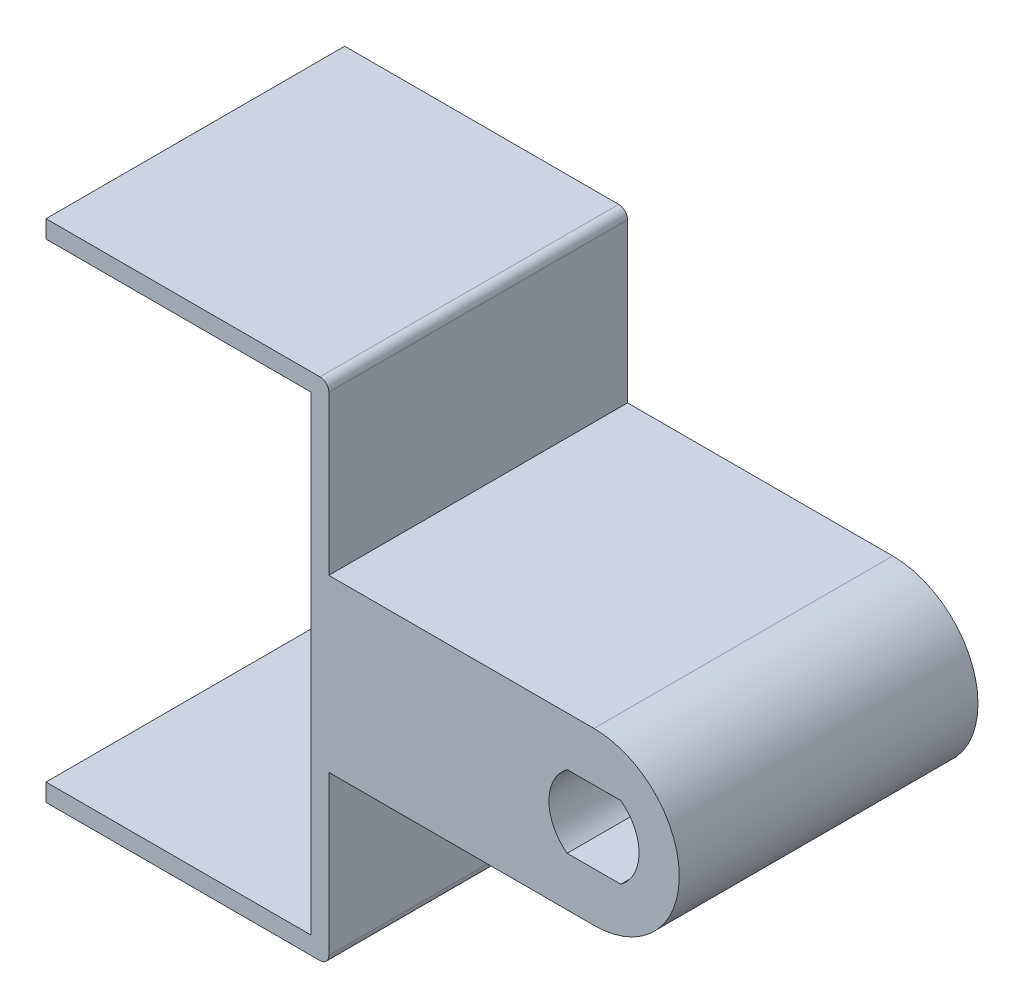
ISO-10303-21;
HEADER;
FILE_DESCRIPTION(('STEP AP214'),'2;1');
FILE_NAME('part.step','',(''),(''),'','','');
FILE_SCHEMA(('AUTOMOTIVE_DESIGN { 1 0 10303 214 1 1 1 1 }'));
ENDSEC;
DATA;
#1=APPLICATION_CONTEXT('core data for automotive mechanical design processes');
#2=APPLICATION_PROTOCOL_DEFINITION('international standard','automotive_design',2000,#1);
#3=PRODUCT_CONTEXT('',#1,'mechanical');
#4=PRODUCT('Part','Part','',(#3));
#5=PRODUCT_RELATED_PRODUCT_CATEGORY('part','',(#4));
#6=PRODUCT_DEFINITION_FORMATION('','',#4);
#7=PRODUCT_DEFINITION_CONTEXT('part definition',#1,'design');
#8=PRODUCT_DEFINITION('design','',#6,#7);
#9=PRODUCT_DEFINITION_SHAPE('','',#8);
#10=(LENGTH_UNIT() NAMED_UNIT(*) SI_UNIT(.MILLI.,.METRE.));
#11=(NAMED_UNIT(*) PLANE_ANGLE_UNIT() SI_UNIT($,.RADIAN.));
#12=(NAMED_UNIT(*) SI_UNIT($,.STERADIAN.) SOLID_ANGLE_UNIT());
#13=UNCERTAINTY_MEASURE_WITH_UNIT(LENGTH_MEASURE(1.E-05),#10,'distance_accuracy_value','');
#14=(GEOMETRIC_REPRESENTATION_CONTEXT(3) GLOBAL_UNCERTAINTY_ASSIGNED_CONTEXT((#13)) GLOBAL_UNIT_ASSIGNED_CONTEXT((#10,
#11,#12)) REPRESENTATION_CONTEXT('',''));
#15=CARTESIAN_POINT('',(0.,0.,0.));
#16=DIRECTION('',(0.,0.,1.));
#17=DIRECTION('',(1.,0.,0.));
#18=AXIS2_PLACEMENT_3D('',#15,#16,#17);
#19=CARTESIAN_POINT('',(21.,-14.3,16.9));
#20=DIRECTION('',(-1.,0.,0.));
#21=DIRECTION('',(0.,0.,1.));
#22=AXIS2_PLACEMENT_3D('',#19,#20,#21);
#23=PLANE('',#22);
#24=DIRECTION('',(0.,1.,0.));
#25=VECTOR('',#24,1.);
#26=CARTESIAN_POINT('',(21.,-14.3,0.));
#27=LINE('',#26,#25);
#28=CARTESIAN_POINT('',(21.,4.825,0.));
#29=VERTEX_POINT('',#28);
#30=CARTESIAN_POINT('',(21.,13.8,0.));
#31=VERTEX_POINT('',#30);
#32=EDGE_CURVE('E232',#29,#31,#27,.T.);
#33=ORIENTED_EDGE('',*,*,#32,.T.);
#34=DIRECTION('',(0.,0.,-1.));
#35=VECTOR('',#34,1.);
#36=CARTESIAN_POINT('',(21.,13.8,16.9));
#37=LINE('',#36,#35);
#38=CARTESIAN_POINT('',(21.,13.8,16.9));
#39=VERTEX_POINT('',#38);
#40=EDGE_CURVE('E55',#31,#39,#37,.F.);
#41=ORIENTED_EDGE('',*,*,#40,.T.);
#42=DIRECTION('',(0.,1.,0.));
#43=VECTOR('',#42,1.);
#44=CARTESIAN_POINT('',(21.,-14.3,16.9));
#45=LINE('',#44,#43);
#46=CARTESIAN_POINT('',(21.,4.825,16.9));
#47=VERTEX_POINT('',#46);
#48=EDGE_CURVE('E218',#47,#39,#45,.T.);
#49=ORIENTED_EDGE('',*,*,#48,.F.);
#50=DIRECTION('',(0.,0.,-1.));
#51=VECTOR('',#50,1.);
#52=CARTESIAN_POINT('',(21.,4.825,13.5));
#53=LINE('',#52,#51);
#54=EDGE_CURVE('E367',#47,#29,#53,.T.);
#55=ORIENTED_EDGE('',*,*,#54,.T.);
#56=EDGE_LOOP('',(#33,#41,#49,#55));
#57=FACE_BOUND('',#56,.T.);
#58=ADVANCED_FACE('F46',(#57),#23,.F.);
#59=CARTESIAN_POINT('',(21.,-13.8,16.9));
#60=VERTEX_POINT('',#59);
#61=CARTESIAN_POINT('',(21.,-4.825,16.9));
#62=VERTEX_POINT('',#61);
#63=EDGE_CURVE('E212',#60,#62,#45,.T.);
#64=ORIENTED_EDGE('',*,*,#63,.F.);
#65=DIRECTION('',(0.,0.,-1.));
#66=VECTOR('',#65,1.);
#67=CARTESIAN_POINT('',(21.,-13.8,16.9));
#68=LINE('',#67,#66);
#69=CARTESIAN_POINT('',(21.,-13.8,0.));
#70=VERTEX_POINT('',#69);
#71=EDGE_CURVE('E12',#60,#70,#68,.T.);
#72=ORIENTED_EDGE('',*,*,#71,.T.);
#73=CARTESIAN_POINT('',(21.,-4.825,0.));
#74=VERTEX_POINT('',#73);
#75=EDGE_CURVE('E234',#70,#74,#27,.T.);
#76=ORIENTED_EDGE('',*,*,#75,.T.);
#77=DIRECTION('',(0.,0.,-1.));
#78=VECTOR('',#77,1.);
#79=CARTESIAN_POINT('',(21.,-4.825,13.5));
#80=LINE('',#79,#78);
#81=EDGE_CURVE('E233',#62,#74,#80,.T.);
#82=ORIENTED_EDGE('',*,*,#81,.F.);
#83=EDGE_LOOP('',(#64,#72,#76,#82));
#84=FACE_BOUND('',#83,.T.);
#85=ADVANCED_FACE('F340',(#84),#23,.F.);
#86=CARTESIAN_POINT('',(-20.,-14.3,16.9));
#87=DIRECTION('',(0.,1.,0.));
#88=DIRECTION('',(0.,0.,1.));
#89=AXIS2_PLACEMENT_3D('',#86,#87,#88);
#90=PLANE('',#89);
#91=DIRECTION('',(1.,0.,0.));
#92=VECTOR('',#91,1.);
#93=CARTESIAN_POINT('',(-20.,-14.3,16.9));
#94=LINE('',#93,#92);
#95=CARTESIAN_POINT('',(5.,-14.3,16.9));
#96=VERTEX_POINT('',#95);
#97=CARTESIAN_POINT('',(20.5,-14.3,16.9));
#98=VERTEX_POINT('',#97);
#99=EDGE_CURVE('E249',#96,#98,#94,.T.);
#100=ORIENTED_EDGE('',*,*,#99,.F.);
#101=DIRECTION('',(0.,0.,-1.));
#102=VECTOR('',#101,1.);
#103=CARTESIAN_POINT('',(5.,-14.3,16.9));
#104=LINE('',#103,#102);
#105=CARTESIAN_POINT('',(5.,-14.3,0.));
#106=VERTEX_POINT('',#105);
#107=EDGE_CURVE('E202',#96,#106,#104,.T.);
#108=ORIENTED_EDGE('',*,*,#107,.T.);
#109=DIRECTION('',(1.,0.,0.));
#110=VECTOR('',#109,1.);
#111=CARTESIAN_POINT('',(-20.,-14.3,0.));
#112=LINE('',#111,#110);
#113=CARTESIAN_POINT('',(20.5,-14.3,0.));
#114=VERTEX_POINT('',#113);
#115=EDGE_CURVE('E229',#106,#114,#112,.T.);
#116=ORIENTED_EDGE('',*,*,#115,.T.);
#117=DIRECTION('',(0.,0.,-1.));
#118=VECTOR('',#117,1.);
#119=CARTESIAN_POINT('',(20.5,-14.3,16.9));
#120=LINE('',#119,#118);
#121=EDGE_CURVE('E362',#114,#98,#120,.F.);
#122=ORIENTED_EDGE('',*,*,#121,.T.);
#123=EDGE_LOOP('',(#100,#108,#116,#122));
#124=FACE_BOUND('',#123,.T.);
#125=ADVANCED_FACE('F346',(#124),#90,.F.);
#126=CARTESIAN_POINT('',(21.,14.3,16.9));
#127=DIRECTION('',(0.,-1.,0.));
#128=DIRECTION('',(1.,0.,0.));
#129=AXIS2_PLACEMENT_3D('',#126,#127,#128);
#130=PLANE('',#129);
#131=DIRECTION('',(-1.,0.,0.));
#132=VECTOR('',#131,1.);
#133=CARTESIAN_POINT('',(21.,14.3,0.));
#134=LINE('',#133,#132);
#135=CARTESIAN_POINT('',(20.5,14.3,0.));
#136=VERTEX_POINT('',#135);
#137=CARTESIAN_POINT('',(5.,14.3,0.));
#138=VERTEX_POINT('',#137);
#139=EDGE_CURVE('E200',#136,#138,#134,.T.);
#140=ORIENTED_EDGE('',*,*,#139,.T.);
#141=DIRECTION('',(0.,0.,-1.));
#142=VECTOR('',#141,1.);
#143=CARTESIAN_POINT('',(5.,14.3,16.9));
#144=LINE('',#143,#142);
#145=CARTESIAN_POINT('',(5.,14.3,16.9));
#146=VERTEX_POINT('',#145);
#147=EDGE_CURVE('E70',#146,#138,#144,.T.);
#148=ORIENTED_EDGE('',*,*,#147,.F.);
#149=DIRECTION('',(-1.,0.,0.));
#150=VECTOR('',#149,1.);
#151=CARTESIAN_POINT('',(21.,14.3,16.9));
#152=LINE('',#151,#150);
#153=CARTESIAN_POINT('',(20.5,14.3,16.9));
#154=VERTEX_POINT('',#153);
#155=EDGE_CURVE('E197',#154,#146,#152,.T.);
#156=ORIENTED_EDGE('',*,*,#155,.F.);
#157=DIRECTION('',(0.,0.,-1.));
#158=VECTOR('',#157,1.);
#159=CARTESIAN_POINT('',(20.5,14.3,16.9));
#160=LINE('',#159,#158);
#161=EDGE_CURVE('E754',#154,#136,#160,.T.);
#162=ORIENTED_EDGE('',*,*,#161,.T.);
#163=EDGE_LOOP('',(#140,#148,#156,#162));
#164=FACE_BOUND('',#163,.T.);
#165=ADVANCED_FACE('F195',(#164),#130,.F.);
#166=CARTESIAN_POINT('',(20.,13.3,16.9));
#167=DIRECTION('',(0.,1.,0.));
#168=DIRECTION('',(0.,0.,1.));
#169=AXIS2_PLACEMENT_3D('',#166,#167,#168);
#170=PLANE('',#169);
#171=DIRECTION('',(1.,0.,0.));
#172=VECTOR('',#171,1.);
#173=CARTESIAN_POINT('',(20.,13.3,16.9));
#174=LINE('',#173,#172);
#175=CARTESIAN_POINT('',(5.,13.3,16.9));
#176=VERTEX_POINT('',#175);
#177=CARTESIAN_POINT('',(20.,13.3,16.9));
#178=VERTEX_POINT('',#177);
#179=EDGE_CURVE('E211',#176,#178,#174,.T.);
#180=ORIENTED_EDGE('',*,*,#179,.F.);
#181=DIRECTION('',(0.,0.,-1.));
#182=VECTOR('',#181,1.);
#183=CARTESIAN_POINT('',(5.,13.3,16.9));
#184=LINE('',#183,#182);
#185=CARTESIAN_POINT('',(5.,13.3,0.));
#186=VERTEX_POINT('',#185);
#187=EDGE_CURVE('E185',#176,#186,#184,.T.);
#188=ORIENTED_EDGE('',*,*,#187,.T.);
#189=DIRECTION('',(1.,0.,0.));
#190=VECTOR('',#189,1.);
#191=CARTESIAN_POINT('',(20.,13.3,0.));
#192=LINE('',#191,#190);
#193=CARTESIAN_POINT('',(20.,13.3,0.));
#194=VERTEX_POINT('',#193);
#195=EDGE_CURVE('E239',#186,#194,#192,.T.);
#196=ORIENTED_EDGE('',*,*,#195,.T.);
#197=DIRECTION('',(0.,0.,-1.));
#198=VECTOR('',#197,1.);
#199=CARTESIAN_POINT('',(20.,13.3,16.9));
#200=LINE('',#199,#198);
#201=EDGE_CURVE('E253',#178,#194,#200,.T.);
#202=ORIENTED_EDGE('',*,*,#201,.F.);
#203=EDGE_LOOP('',(#180,#188,#196,#202));
#204=FACE_BOUND('',#203,.T.);
#205=ADVANCED_FACE('F356',(#204),#170,.F.);
#206=CARTESIAN_POINT('',(20.,-13.3,16.9));
#207=DIRECTION('',(1.,0.,0.));
#208=DIRECTION('',(0.,0.,-1.));
#209=AXIS2_PLACEMENT_3D('',#206,#207,#208);
#210=PLANE('',#209);
#211=DIRECTION('',(0.,-1.,0.));
#212=VECTOR('',#211,1.);
#213=CARTESIAN_POINT('',(20.,-13.3,0.));
#214=LINE('',#213,#212);
#215=CARTESIAN_POINT('',(20.,-13.3,0.));
#216=VERTEX_POINT('',#215);
#217=EDGE_CURVE('E242',#194,#216,#214,.T.);
#218=ORIENTED_EDGE('',*,*,#217,.T.);
#219=DIRECTION('',(0.,0.,-1.));
#220=VECTOR('',#219,1.);
#221=CARTESIAN_POINT('',(20.,-13.3,16.9));
#222=LINE('',#221,#220);
#223=CARTESIAN_POINT('',(20.,-13.3,16.9));
#224=VERTEX_POINT('',#223);
#225=EDGE_CURVE('E228',#224,#216,#222,.T.);
#226=ORIENTED_EDGE('',*,*,#225,.F.);
#227=DIRECTION('',(0.,-1.,0.));
#228=VECTOR('',#227,1.);
#229=CARTESIAN_POINT('',(20.,-13.3,16.9));
#230=LINE('',#229,#228);
#231=EDGE_CURVE('E216',#178,#224,#230,.T.);
#232=ORIENTED_EDGE('',*,*,#231,.F.);
#233=ORIENTED_EDGE('',*,*,#201,.T.);
#234=EDGE_LOOP('',(#218,#226,#232,#233));
#235=FACE_BOUND('',#234,.T.);
#236=ADVANCED_FACE('F467',(#235),#210,.F.);
#237=CARTESIAN_POINT('',(-20.,-13.3,16.9));
#238=DIRECTION('',(0.,-1.,0.));
#239=DIRECTION('',(0.,0.,-1.));
#240=AXIS2_PLACEMENT_3D('',#237,#238,#239);
#241=PLANE('',#240);
#242=DIRECTION('',(-1.,0.,0.));
#243=VECTOR('',#242,1.);
#244=CARTESIAN_POINT('',(-20.,-13.3,0.));
#245=LINE('',#244,#243);
#246=CARTESIAN_POINT('',(5.,-13.3,0.));
#247=VERTEX_POINT('',#246);
#248=EDGE_CURVE('E245',#216,#247,#245,.T.);
#249=ORIENTED_EDGE('',*,*,#248,.T.);
#250=DIRECTION('',(0.,0.,1.));
#251=VECTOR('',#250,1.);
#252=CARTESIAN_POINT('',(5.,-13.3,16.9));
#253=LINE('',#252,#251);
#254=CARTESIAN_POINT('',(5.,-13.3,16.9));
#255=VERTEX_POINT('',#254);
#256=EDGE_CURVE('E62',#247,#255,#253,.T.);
#257=ORIENTED_EDGE('',*,*,#256,.T.);
#258=DIRECTION('',(-1.,0.,0.));
#259=VECTOR('',#258,1.);
#260=CARTESIAN_POINT('',(-20.,-13.3,16.9));
#261=LINE('',#260,#259);
#262=EDGE_CURVE('E224',#224,#255,#261,.T.);
#263=ORIENTED_EDGE('',*,*,#262,.F.);
#264=ORIENTED_EDGE('',*,*,#225,.T.);
#265=EDGE_LOOP('',(#249,#257,#263,#264));
#266=FACE_BOUND('',#265,.T.);
#267=ADVANCED_FACE('F462',(#266),#241,.F.);
#268=CARTESIAN_POINT('',(0.,0.,16.9));
#269=DIRECTION('',(0.,0.,1.));
#270=DIRECTION('',(1.,0.,0.));
#271=AXIS2_PLACEMENT_3D('',#268,#269,#270);
#272=PLANE('',#271);
#273=DIRECTION('',(0.,-1.,0.));
#274=VECTOR('',#273,1.);
#275=CARTESIAN_POINT('',(5.,14.3,16.9));
#276=LINE('',#275,#274);
#277=EDGE_CURVE('E190',#255,#96,#276,.T.);
#278=ORIENTED_EDGE('',*,*,#277,.T.);
#279=ORIENTED_EDGE('',*,*,#99,.T.);
#280=CARTESIAN_POINT('',(20.5,-13.8,16.9));
#281=DIRECTION('',(0.,0.,1.));
#282=DIRECTION('',(1.,0.,0.));
#283=AXIS2_PLACEMENT_3D('',#280,#281,#282);
#284=CIRCLE('',#283,0.5);
#285=EDGE_CURVE('E751',#98,#60,#284,.T.);
#286=ORIENTED_EDGE('',*,*,#285,.T.);
#287=ORIENTED_EDGE('',*,*,#63,.T.);
#288=DIRECTION('',(1.,0.,0.));
#289=VECTOR('',#288,1.);
#290=CARTESIAN_POINT('',(21.,-4.825,16.9));
#291=LINE('',#290,#289);
#292=CARTESIAN_POINT('',(36.,-4.825,16.9));
#293=VERTEX_POINT('',#292);
#294=EDGE_CURVE('E392',#62,#293,#291,.T.);
#295=ORIENTED_EDGE('',*,*,#294,.T.);
#296=CARTESIAN_POINT('',(36.,0.,16.9));
#297=DIRECTION('',(0.,0.,1.));
#298=DIRECTION('',(1.,0.,0.));
#299=AXIS2_PLACEMENT_3D('',#296,#297,#298);
#300=CIRCLE('',#299,4.825);
#301=CARTESIAN_POINT('',(36.,4.825,16.9));
#302=VERTEX_POINT('',#301);
#303=EDGE_CURVE('E393',#293,#302,#300,.T.);
#304=ORIENTED_EDGE('',*,*,#303,.T.);
#305=DIRECTION('',(-1.,0.,0.));
#306=VECTOR('',#305,1.);
#307=CARTESIAN_POINT('',(36.,4.825,16.9));
#308=LINE('',#307,#306);
#309=EDGE_CURVE('E397',#302,#47,#308,.T.);
#310=ORIENTED_EDGE('',*,*,#309,.T.);
#311=ORIENTED_EDGE('',*,*,#48,.T.);
#312=CARTESIAN_POINT('',(20.5,13.8,16.9));
#313=DIRECTION('',(0.,0.,1.));
#314=DIRECTION('',(1.,0.,0.));
#315=AXIS2_PLACEMENT_3D('',#312,#313,#314);
#316=CIRCLE('',#315,0.5);
#317=EDGE_CURVE('E209',#39,#154,#316,.T.);
#318=ORIENTED_EDGE('',*,*,#317,.T.);
#319=ORIENTED_EDGE('',*,*,#155,.T.);
#320=EDGE_CURVE('E182',#146,#176,#276,.T.);
#321=ORIENTED_EDGE('',*,*,#320,.T.);
#322=ORIENTED_EDGE('',*,*,#179,.T.);
#323=ORIENTED_EDGE('',*,*,#231,.T.);
#324=ORIENTED_EDGE('',*,*,#262,.T.);
#325=EDGE_LOOP('',(#278,#279,#286,#287,#295,#304,#310,#311,#318,#319,#321,#322,#323,#324));
#326=FACE_BOUND('',#325,.T.);
#327=CARTESIAN_POINT('',(36.,2.4980018054066E-13,16.9));
#328=DIRECTION('',(0.,0.,-1.));
#329=DIRECTION('',(-1.,0.,0.));
#330=AXIS2_PLACEMENT_3D('',#327,#328,#329);
#331=CIRCLE('',#330,2.55000000000028);
#332=CARTESIAN_POINT('',(34.4834249111896,-2.05,16.9));
#333=VERTEX_POINT('',#332);
#334=CARTESIAN_POINT('',(34.4834249111889,2.05,16.9));
#335=VERTEX_POINT('',#334);
#336=EDGE_CURVE('E440',#333,#335,#331,.T.);
#337=ORIENTED_EDGE('',*,*,#336,.T.);
#338=DIRECTION('',(1.,0.,0.));
#339=VECTOR('',#338,1.);
#340=CARTESIAN_POINT('',(34.4834249111889,2.05,16.9));
#341=LINE('',#340,#339);
#342=CARTESIAN_POINT('',(37.5165750888108,2.05,16.9));
#343=VERTEX_POINT('',#342);
#344=EDGE_CURVE('E436',#335,#343,#341,.T.);
#345=ORIENTED_EDGE('',*,*,#344,.T.);
#346=CARTESIAN_POINT('',(36.,2.4980018054066E-13,16.9));
#347=DIRECTION('',(0.,0.,-1.));
#348=DIRECTION('',(-1.,0.,0.));
#349=AXIS2_PLACEMENT_3D('',#346,#347,#348);
#350=CIRCLE('',#349,2.5500000000001);
#351=CARTESIAN_POINT('',(37.5165750888102,-2.05,16.9));
#352=VERTEX_POINT('',#351);
#353=EDGE_CURVE('E432',#343,#352,#350,.T.);
#354=ORIENTED_EDGE('',*,*,#353,.T.);
#355=DIRECTION('',(-1.,0.,0.));
#356=VECTOR('',#355,1.);
#357=CARTESIAN_POINT('',(37.5165750888102,-2.05,16.9));
#358=LINE('',#357,#356);
#359=EDGE_CURVE('E419',#352,#333,#358,.T.);
#360=ORIENTED_EDGE('',*,*,#359,.T.);
#361=EDGE_LOOP('',(#337,#345,#354,#360));
#362=FACE_BOUND('',#361,.T.);
#363=ADVANCED_FACE('F205',(#326,#362),#272,.T.);
#364=CARTESIAN_POINT('',(0.,0.,0.));
#365=DIRECTION('',(0.,0.,1.));
#366=DIRECTION('',(1.,0.,0.));
#367=AXIS2_PLACEMENT_3D('',#364,#365,#366);
#368=PLANE('',#367);
#369=DIRECTION('',(1.,0.,0.));
#370=VECTOR('',#369,1.);
#371=CARTESIAN_POINT('',(37.5,-3.15470053837926,0.));
#372=LINE('',#371,#370);
#373=CARTESIAN_POINT('',(34.1548169363503,-3.15470053837926,0.));
#374=VERTEX_POINT('',#373);
#375=CARTESIAN_POINT('',(37.8451830636492,-3.15470053837926,0.));
#376=VERTEX_POINT('',#375);
#377=EDGE_CURVE('E264',#374,#376,#372,.T.);
#378=ORIENTED_EDGE('',*,*,#377,.T.);
#379=CARTESIAN_POINT('',(36.,2.4980018054066E-13,0.));
#380=DIRECTION('',(0.,0.,1.));
#381=DIRECTION('',(1.,0.,0.));
#382=AXIS2_PLACEMENT_3D('',#379,#380,#381);
#383=CIRCLE('',#382,3.65470053837926);
#384=CARTESIAN_POINT('',(37.84518306365,3.15470053837926,0.));
#385=VERTEX_POINT('',#384);
#386=EDGE_CURVE('E267',#376,#385,#383,.T.);
#387=ORIENTED_EDGE('',*,*,#386,.T.);
#388=DIRECTION('',(-1.,0.,0.));
#389=VECTOR('',#388,1.);
#390=CARTESIAN_POINT('',(34.4999999999996,3.15470053837926,0.));
#391=LINE('',#390,#389);
#392=CARTESIAN_POINT('',(34.1548169363495,3.15470053837926,0.));
#393=VERTEX_POINT('',#392);
#394=EDGE_CURVE('E257',#385,#393,#391,.T.);
#395=ORIENTED_EDGE('',*,*,#394,.T.);
#396=CARTESIAN_POINT('',(36.,2.4980018054066E-13,0.));
#397=DIRECTION('',(0.,0.,1.));
#398=DIRECTION('',(1.,0.,0.));
#399=AXIS2_PLACEMENT_3D('',#396,#397,#398);
#400=CIRCLE('',#399,3.65470053837953);
#401=EDGE_CURVE('E261',#393,#374,#400,.T.);
#402=ORIENTED_EDGE('',*,*,#401,.T.);
#403=EDGE_LOOP('',(#378,#387,#395,#402));
#404=FACE_BOUND('',#403,.T.);
#405=ORIENTED_EDGE('',*,*,#115,.F.);
#406=DIRECTION('',(0.,-1.,0.));
#407=VECTOR('',#406,1.);
#408=CARTESIAN_POINT('',(5.,14.3,0.));
#409=LINE('',#408,#407);
#410=EDGE_CURVE('E452',#247,#106,#409,.T.);
#411=ORIENTED_EDGE('',*,*,#410,.F.);
#412=ORIENTED_EDGE('',*,*,#248,.F.);
#413=ORIENTED_EDGE('',*,*,#217,.F.);
#414=ORIENTED_EDGE('',*,*,#195,.F.);
#415=EDGE_CURVE('E450',#138,#186,#409,.T.);
#416=ORIENTED_EDGE('',*,*,#415,.F.);
#417=ORIENTED_EDGE('',*,*,#139,.F.);
#418=CARTESIAN_POINT('',(20.5,13.8,0.));
#419=DIRECTION('',(0.,0.,1.));
#420=DIRECTION('',(1.,0.,0.));
#421=AXIS2_PLACEMENT_3D('',#418,#419,#420);
#422=CIRCLE('',#421,0.5);
#423=EDGE_CURVE('E744',#136,#31,#422,.F.);
#424=ORIENTED_EDGE('',*,*,#423,.T.);
#425=ORIENTED_EDGE('',*,*,#32,.F.);
#426=DIRECTION('',(1.,0.,0.));
#427=VECTOR('',#426,1.);
#428=CARTESIAN_POINT('',(21.,4.825,0.));
#429=LINE('',#428,#427);
#430=CARTESIAN_POINT('',(36.,4.825,0.));
#431=VERTEX_POINT('',#430);
#432=EDGE_CURVE('E388',#29,#431,#429,.T.);
#433=ORIENTED_EDGE('',*,*,#432,.T.);
#434=CARTESIAN_POINT('',(36.,0.,0.));
#435=DIRECTION('',(0.,0.,-1.));
#436=DIRECTION('',(-1.,0.,0.));
#437=AXIS2_PLACEMENT_3D('',#434,#435,#436);
#438=CIRCLE('',#437,4.825);
#439=CARTESIAN_POINT('',(36.,-4.825,0.));
#440=VERTEX_POINT('',#439);
#441=EDGE_CURVE('E385',#431,#440,#438,.T.);
#442=ORIENTED_EDGE('',*,*,#441,.T.);
#443=DIRECTION('',(-1.,0.,0.));
#444=VECTOR('',#443,1.);
#445=CARTESIAN_POINT('',(36.,-4.825,0.));
#446=LINE('',#445,#444);
#447=EDGE_CURVE('E372',#440,#74,#446,.T.);
#448=ORIENTED_EDGE('',*,*,#447,.T.);
#449=ORIENTED_EDGE('',*,*,#75,.F.);
#450=CARTESIAN_POINT('',(20.5,-13.8,0.));
#451=DIRECTION('',(0.,0.,1.));
#452=DIRECTION('',(1.,0.,0.));
#453=AXIS2_PLACEMENT_3D('',#450,#451,#452);
#454=CIRCLE('',#453,0.5);
#455=EDGE_CURVE('E759',#70,#114,#454,.F.);
#456=ORIENTED_EDGE('',*,*,#455,.T.);
#457=EDGE_LOOP('',(#405,#411,#412,#413,#414,#416,#417,#424,#425,#433,#442,#448,#449,#456));
#458=FACE_BOUND('',#457,.T.);
#459=ADVANCED_FACE('F458',(#404,#458),#368,.F.);
#460=CARTESIAN_POINT('',(36.,-4.825,13.5));
#461=DIRECTION('',(0.,-1.,0.));
#462=DIRECTION('',(1.,0.,0.));
#463=AXIS2_PLACEMENT_3D('',#460,#461,#462);
#464=PLANE('',#463);
#465=ORIENTED_EDGE('',*,*,#447,.F.);
#466=DIRECTION('',(0.,0.,-1.));
#467=VECTOR('',#466,1.);
#468=CARTESIAN_POINT('',(36.,-4.825,13.5));
#469=LINE('',#468,#467);
#470=EDGE_CURVE('E375',#293,#440,#469,.T.);
#471=ORIENTED_EDGE('',*,*,#470,.F.);
#472=ORIENTED_EDGE('',*,*,#294,.F.);
#473=ORIENTED_EDGE('',*,*,#81,.T.);
#474=EDGE_LOOP('',(#465,#471,#472,#473));
#475=FACE_BOUND('',#474,.T.);
#476=ADVANCED_FACE('F481',(#475),#464,.T.);
#477=CARTESIAN_POINT('',(36.,0.,13.5));
#478=DIRECTION('',(0.,0.,-1.));
#479=DIRECTION('',(-1.,0.,0.));
#480=AXIS2_PLACEMENT_3D('',#477,#478,#479);
#481=CYLINDRICAL_SURFACE('',#480,4.825);
#482=ORIENTED_EDGE('',*,*,#470,.T.);
#483=ORIENTED_EDGE('',*,*,#441,.F.);
#484=DIRECTION('',(0.,0.,-1.));
#485=VECTOR('',#484,1.);
#486=CARTESIAN_POINT('',(36.,4.825,13.5));
#487=LINE('',#486,#485);
#488=EDGE_CURVE('E371',#302,#431,#487,.T.);
#489=ORIENTED_EDGE('',*,*,#488,.F.);
#490=ORIENTED_EDGE('',*,*,#303,.F.);
#491=EDGE_LOOP('',(#482,#483,#489,#490));
#492=FACE_BOUND('',#491,.T.);
#493=ADVANCED_FACE('F487',(#492),#481,.T.);
#494=CARTESIAN_POINT('',(21.,4.825,13.5));
#495=DIRECTION('',(0.,1.,0.));
#496=DIRECTION('',(-1.,0.,0.));
#497=AXIS2_PLACEMENT_3D('',#494,#495,#496);
#498=PLANE('',#497);
#499=ORIENTED_EDGE('',*,*,#432,.F.);
#500=ORIENTED_EDGE('',*,*,#54,.F.);
#501=ORIENTED_EDGE('',*,*,#309,.F.);
#502=ORIENTED_EDGE('',*,*,#488,.T.);
#503=EDGE_LOOP('',(#499,#500,#501,#502));
#504=FACE_BOUND('',#503,.T.);
#505=ADVANCED_FACE('F324',(#504),#498,.T.);
#506=CARTESIAN_POINT('',(36.,2.4980018054066E-13,0.));
#507=DIRECTION('',(0.,0.,-1.));
#508=DIRECTION('',(-1.,0.,0.));
#509=AXIS2_PLACEMENT_3D('',#506,#507,#508);
#510=CONICAL_SURFACE('',#509,3.65470053837953,0.523598775598297);
#511=CARTESIAN_POINT('',(36.,2.4980018054066E-13,1.91339745962157));
#512=DIRECTION('',(0.,0.,-1.));
#513=DIRECTION('',(-1.,0.,0.));
#514=AXIS2_PLACEMENT_3D('',#511,#512,#513);
#515=CIRCLE('',#514,2.55000000000028);
#516=CARTESIAN_POINT('',(34.4834249111896,-2.05,1.91339745962157));
#517=VERTEX_POINT('',#516);
#518=CARTESIAN_POINT('',(34.4834249111889,2.05,1.91339745962157));
#519=VERTEX_POINT('',#518);
#520=EDGE_CURVE('E282',#517,#519,#515,.T.);
#521=ORIENTED_EDGE('',*,*,#520,.F.);
#522=CARTESIAN_POINT('',(34.4999999999996,-2.,2.00000000000002));
#523=CARTESIAN_POINT('',(34.4680206898571,-2.09597972634379,1.83375823747601));
#524=CARTESIAN_POINT('',(34.4370098038124,-2.19203881554799,1.66737901444555));
#525=CARTESIAN_POINT('',(34.3766687192747,-2.38428346218164,1.33440151899294));
#526=CARTESIAN_POINT('',(34.3473384251926,-2.48046901209928,1.16780325958164));
#527=CARTESIAN_POINT('',(34.2900995127356,-2.67294279803823,0.83442888321023));
#528=CARTESIAN_POINT('',(34.2621908580411,-2.76923103137202,0.66765277090507));
#529=CARTESIAN_POINT('',(34.2076158956177,-2.96190114716729,0.33393834124748));
#530=CARTESIAN_POINT('',(34.1809496584722,-3.05828303463261,0.167000015228157));
#531=CARTESIAN_POINT('',(34.1548169363503,-3.15470053837926,0.));
#532=B_SPLINE_CURVE_WITH_KNOTS('',3,(#522,#523,#524,#525,#526,#527,#528,#529,#530,#531),
.UNSPECIFIED.,.F.,.F.,(4,2,2,2,4),(0.,0.583808837990597,1.16758443697856,1.75134511441586,
2.33513891566343),.UNSPECIFIED.);
#533=EDGE_CURVE('E312',#374,#517,#532,.F.);
#534=ORIENTED_EDGE('',*,*,#533,.F.);
#535=ORIENTED_EDGE('',*,*,#401,.F.);
#536=CARTESIAN_POINT('',(34.4999999999996,2.,2.00000000000002));
#537=CARTESIAN_POINT('',(34.4680206898566,2.09597972634376,1.83375823747606));
#538=CARTESIAN_POINT('',(34.4370098038118,2.19203881554795,1.66737901444561));
#539=CARTESIAN_POINT('',(34.3766687192739,2.3842834621816,1.33440151899301));
#540=CARTESIAN_POINT('',(34.3473384251919,2.48046901209924,1.1678032595817));
#541=CARTESIAN_POINT('',(34.2900995127348,2.67294279803821,0.834428883210265));
#542=CARTESIAN_POINT('',(34.2621908580403,2.769231031372,0.667652770905099));
#543=CARTESIAN_POINT('',(34.2076158956169,2.96190114716728,0.333938341247497));
#544=CARTESIAN_POINT('',(34.1809496584713,3.05828303463261,0.167000015228168));
#545=CARTESIAN_POINT('',(34.1548169363495,3.15470053837926,0.));
#546=B_SPLINE_CURVE_WITH_KNOTS('',3,(#536,#537,#538,#539,#540,#541,#542,#543,#544,#545),
.UNSPECIFIED.,.F.,.F.,(4,2,2,2,4),(0.,0.583808837990634,1.16758443697863,1.75134511441596,
2.33513891566356),.UNSPECIFIED.);
#547=EDGE_CURVE('E305',#519,#393,#546,.T.);
#548=ORIENTED_EDGE('',*,*,#547,.F.);
#549=EDGE_LOOP('',(#521,#534,#535,#548));
#550=FACE_BOUND('',#549,.T.);
#551=ADVANCED_FACE('F319',(#550),#510,.F.);
#552=CARTESIAN_POINT('',(0.,-3.15470053837926,0.));
#553=DIRECTION('',(0.,0.866025403784439,-0.5));
#554=DIRECTION('',(-1.,0.,0.));
#555=AXIS2_PLACEMENT_3D('',#552,#553,#554);
#556=PLANE('',#555);
#557=DIRECTION('',(-1.,0.,0.));
#558=VECTOR('',#557,1.);
#559=CARTESIAN_POINT('',(0.,-2.05,1.91339745962157));
#560=LINE('',#559,#558);
#561=CARTESIAN_POINT('',(37.5165750888102,-2.05,1.9133974596214));
#562=VERTEX_POINT('',#561);
#563=EDGE_CURVE('E406',#562,#517,#560,.T.);
#564=ORIENTED_EDGE('',*,*,#563,.F.);
#565=CARTESIAN_POINT('',(37.5,-2.,2.00000000000002));
#566=CARTESIAN_POINT('',(37.5319793101425,-2.09597972634379,1.83375823747601));
#567=CARTESIAN_POINT('',(37.5629901961872,-2.19203881554799,1.66737901444555));
#568=CARTESIAN_POINT('',(37.6233312807249,-2.38428346218164,1.33440151899294));
#569=CARTESIAN_POINT('',(37.6526615748069,-2.48046901209928,1.16780325958165));
#570=CARTESIAN_POINT('',(37.709900487264,-2.67294279803823,0.83442888321023));
#571=CARTESIAN_POINT('',(37.7378091419585,-2.76923103137202,0.66765277090507));
#572=CARTESIAN_POINT('',(37.7923841043818,-2.96190114716729,0.33393834124748));
#573=CARTESIAN_POINT('',(37.8190503415273,-3.05828303463261,0.167000015228157));
#574=CARTESIAN_POINT('',(37.8451830636492,-3.15470053837926,0.));
#575=B_SPLINE_CURVE_WITH_KNOTS('',3,(#565,#566,#567,#568,#569,#570,#571,#572,#573,#574),
.UNSPECIFIED.,.F.,.F.,(4,2,2,2,4),(0.,0.583808837990592,1.16758443697856,1.75134511441585,
2.33513891566342),.UNSPECIFIED.);
#576=EDGE_CURVE('E281',#376,#562,#575,.F.);
#577=ORIENTED_EDGE('',*,*,#576,.F.);
#578=ORIENTED_EDGE('',*,*,#377,.F.);
#579=ORIENTED_EDGE('',*,*,#533,.T.);
#580=EDGE_LOOP('',(#564,#577,#578,#579));
#581=FACE_BOUND('',#580,.T.);
#582=ADVANCED_FACE('F300',(#581),#556,.T.);
#583=CARTESIAN_POINT('',(0.,3.15470053837926,0.));
#584=DIRECTION('',(0.,-0.866025403784439,-0.5));
#585=DIRECTION('',(1.,0.,0.));
#586=AXIS2_PLACEMENT_3D('',#583,#584,#585);
#587=PLANE('',#586);
#588=DIRECTION('',(1.,0.,0.));
#589=VECTOR('',#588,1.);
#590=CARTESIAN_POINT('',(0.,2.04999999999999,1.91339745962158));
#591=LINE('',#590,#589);
#592=CARTESIAN_POINT('',(37.5165750888107,2.05000000000024,1.91339745962115));
#593=VERTEX_POINT('',#592);
#594=EDGE_CURVE('E409',#519,#593,#591,.T.);
#595=ORIENTED_EDGE('',*,*,#594,.F.);
#596=ORIENTED_EDGE('',*,*,#547,.T.);
#597=ORIENTED_EDGE('',*,*,#394,.F.);
#598=CARTESIAN_POINT('',(37.84518306365,3.15470053837926,0.));
#599=CARTESIAN_POINT('',(37.8190503415281,3.05828303463261,0.16700001522816));
#600=CARTESIAN_POINT('',(37.7923841043826,2.96190114716729,0.333938341247482));
#601=CARTESIAN_POINT('',(37.7378091419593,2.76923103137202,0.667652770905071));
#602=CARTESIAN_POINT('',(37.7099004872647,2.67294279803824,0.834428883210229));
#603=CARTESIAN_POINT('',(37.6526615748077,2.48046901209927,1.16780325958165));
#604=CARTESIAN_POINT('',(37.6233312807256,2.38428346218164,1.33440151899295));
#605=CARTESIAN_POINT('',(37.5629901961878,2.19203881554799,1.66737901444554));
#606=CARTESIAN_POINT('',(37.5319793101431,2.0959797263438,1.83375823747599));
#607=CARTESIAN_POINT('',(37.5000000000004,2.00000000000003,1.99999999999997));
#608=B_SPLINE_CURVE_WITH_KNOTS('',3,(#598,#599,#600,#601,#602,#603,#604,#605,#606,#607),
.UNSPECIFIED.,.F.,.F.,(4,2,2,2,4),(0.,0.583793801247576,1.16755447868487,1.75133007767284,
2.33513891566344),.UNSPECIFIED.);
#609=EDGE_CURVE('E272',#593,#385,#608,.F.);
#610=ORIENTED_EDGE('',*,*,#609,.F.);
#611=EDGE_LOOP('',(#595,#596,#597,#610));
#612=FACE_BOUND('',#611,.T.);
#613=ADVANCED_FACE('F294',(#612),#587,.T.);
#614=CARTESIAN_POINT('',(36.,2.4980018054066E-13,0.));
#615=DIRECTION('',(0.,0.,-1.));
#616=DIRECTION('',(-1.,0.,0.));
#617=AXIS2_PLACEMENT_3D('',#614,#615,#616);
#618=CONICAL_SURFACE('',#617,3.65470053837926,0.523598775598297);
#619=CARTESIAN_POINT('',(36.,2.4980018054066E-13,1.9133974596214));
#620=DIRECTION('',(0.,0.,-1.));
#621=DIRECTION('',(-1.,0.,0.));
#622=AXIS2_PLACEMENT_3D('',#619,#620,#621);
#623=CIRCLE('',#622,2.5500000000001);
#624=EDGE_CURVE('E271',#593,#562,#623,.T.);
#625=ORIENTED_EDGE('',*,*,#624,.F.);
#626=ORIENTED_EDGE('',*,*,#609,.T.);
#627=ORIENTED_EDGE('',*,*,#386,.F.);
#628=ORIENTED_EDGE('',*,*,#576,.T.);
#629=EDGE_LOOP('',(#625,#626,#627,#628));
#630=FACE_BOUND('',#629,.T.);
#631=ADVANCED_FACE('F290',(#630),#618,.F.);
#632=CARTESIAN_POINT('',(36.,2.4980018054066E-13,16.9));
#633=DIRECTION('',(0.,0.,-1.));
#634=DIRECTION('',(-1.,0.,0.));
#635=AXIS2_PLACEMENT_3D('',#632,#633,#634);
#636=CYLINDRICAL_SURFACE('',#635,2.55000000000028);
#637=ORIENTED_EDGE('',*,*,#520,.T.);
#638=DIRECTION('',(0.,0.,-1.));
#639=VECTOR('',#638,1.);
#640=CARTESIAN_POINT('',(34.4834249111889,2.05,16.9));
#641=LINE('',#640,#639);
#642=EDGE_CURVE('E414',#335,#519,#641,.T.);
#643=ORIENTED_EDGE('',*,*,#642,.F.);
#644=ORIENTED_EDGE('',*,*,#336,.F.);
#645=DIRECTION('',(0.,0.,-1.));
#646=VECTOR('',#645,1.);
#647=CARTESIAN_POINT('',(34.4834249111896,-2.05,16.9));
#648=LINE('',#647,#646);
#649=EDGE_CURVE('E413',#333,#517,#648,.T.);
#650=ORIENTED_EDGE('',*,*,#649,.T.);
#651=EDGE_LOOP('',(#637,#643,#644,#650));
#652=FACE_BOUND('',#651,.T.);
#653=ADVANCED_FACE('F495',(#652),#636,.F.);
#654=CARTESIAN_POINT('',(37.5165750888102,-2.05,16.9));
#655=DIRECTION('',(0.,-1.,0.));
#656=DIRECTION('',(0.,0.,-1.));
#657=AXIS2_PLACEMENT_3D('',#654,#655,#656);
#658=PLANE('',#657);
#659=ORIENTED_EDGE('',*,*,#563,.T.);
#660=ORIENTED_EDGE('',*,*,#649,.F.);
#661=ORIENTED_EDGE('',*,*,#359,.F.);
#662=DIRECTION('',(0.,0.,-1.));
#663=VECTOR('',#662,1.);
#664=CARTESIAN_POINT('',(37.5165750888102,-2.05,16.9));
#665=LINE('',#664,#663);
#666=EDGE_CURVE('E422',#352,#562,#665,.T.);
#667=ORIENTED_EDGE('',*,*,#666,.T.);
#668=EDGE_LOOP('',(#659,#660,#661,#667));
#669=FACE_BOUND('',#668,.T.);
#670=ADVANCED_FACE('F497',(#669),#658,.F.);
#671=CARTESIAN_POINT('',(36.,2.4980018054066E-13,16.9));
#672=DIRECTION('',(0.,0.,-1.));
#673=DIRECTION('',(-1.,0.,0.));
#674=AXIS2_PLACEMENT_3D('',#671,#672,#673);
#675=CYLINDRICAL_SURFACE('',#674,2.5500000000001);
#676=ORIENTED_EDGE('',*,*,#624,.T.);
#677=ORIENTED_EDGE('',*,*,#666,.F.);
#678=ORIENTED_EDGE('',*,*,#353,.F.);
#679=DIRECTION('',(0.,0.,-1.));
#680=VECTOR('',#679,1.);
#681=CARTESIAN_POINT('',(37.5165750888108,2.05,16.9));
#682=LINE('',#681,#680);
#683=EDGE_CURVE('E418',#343,#593,#682,.T.);
#684=ORIENTED_EDGE('',*,*,#683,.T.);
#685=EDGE_LOOP('',(#676,#677,#678,#684));
#686=FACE_BOUND('',#685,.T.);
#687=ADVANCED_FACE('F336',(#686),#675,.F.);
#688=CARTESIAN_POINT('',(34.4834249111889,2.05,16.9));
#689=DIRECTION('',(0.,1.,0.));
#690=DIRECTION('',(-1.,0.,0.));
#691=AXIS2_PLACEMENT_3D('',#688,#689,#690);
#692=PLANE('',#691);
#693=ORIENTED_EDGE('',*,*,#594,.T.);
#694=ORIENTED_EDGE('',*,*,#683,.F.);
#695=ORIENTED_EDGE('',*,*,#344,.F.);
#696=ORIENTED_EDGE('',*,*,#642,.T.);
#697=EDGE_LOOP('',(#693,#694,#695,#696));
#698=FACE_BOUND('',#697,.T.);
#699=ADVANCED_FACE('F329',(#698),#692,.F.);
#700=CARTESIAN_POINT('',(20.5,13.8,16.9));
#701=DIRECTION('',(0.,0.,-1.));
#702=DIRECTION('',(-1.,0.,0.));
#703=AXIS2_PLACEMENT_3D('',#700,#701,#702);
#704=CYLINDRICAL_SURFACE('',#703,0.5);
#705=ORIENTED_EDGE('',*,*,#317,.F.);
#706=ORIENTED_EDGE('',*,*,#40,.F.);
#707=ORIENTED_EDGE('',*,*,#423,.F.);
#708=ORIENTED_EDGE('',*,*,#161,.F.);
#709=EDGE_LOOP('',(#705,#706,#707,#708));
#710=FACE_BOUND('',#709,.T.);
#711=ADVANCED_FACE('F326',(#710),#704,.T.);
#712=CARTESIAN_POINT('',(20.5,-13.8,16.9));
#713=DIRECTION('',(0.,0.,-1.));
#714=DIRECTION('',(-1.,0.,0.));
#715=AXIS2_PLACEMENT_3D('',#712,#713,#714);
#716=CYLINDRICAL_SURFACE('',#715,0.5);
#717=ORIENTED_EDGE('',*,*,#285,.F.);
#718=ORIENTED_EDGE('',*,*,#121,.F.);
#719=ORIENTED_EDGE('',*,*,#455,.F.);
#720=ORIENTED_EDGE('',*,*,#71,.F.);
#721=EDGE_LOOP('',(#717,#718,#719,#720));
#722=FACE_BOUND('',#721,.T.);
#723=ADVANCED_FACE('F48',(#722),#716,.T.);
#724=CARTESIAN_POINT('',(5.,14.3,16.9));
#725=DIRECTION('',(1.,0.,0.));
#726=DIRECTION('',(0.,1.,0.));
#727=AXIS2_PLACEMENT_3D('',#724,#725,#726);
#728=PLANE('',#727);
#729=ORIENTED_EDGE('',*,*,#320,.F.);
#730=ORIENTED_EDGE('',*,*,#147,.T.);
#731=ORIENTED_EDGE('',*,*,#415,.T.);
#732=ORIENTED_EDGE('',*,*,#187,.F.);
#733=EDGE_LOOP('',(#729,#730,#731,#732));
#734=FACE_BOUND('',#733,.T.);
#735=ADVANCED_FACE('F183',(#734),#728,.F.);
#736=ORIENTED_EDGE('',*,*,#410,.T.);
#737=ORIENTED_EDGE('',*,*,#107,.F.);
#738=ORIENTED_EDGE('',*,*,#277,.F.);
#739=ORIENTED_EDGE('',*,*,#256,.F.);
#740=EDGE_LOOP('',(#736,#737,#738,#739));
#741=FACE_BOUND('',#740,.T.);
#742=ADVANCED_FACE('F455',(#741),#728,.F.);
#743=CLOSED_SHELL('',(#58,#85,#125,#165,#205,#236,#267,#363,#459,#476,#493,#505,#551,#582,#613,
#631,#653,#670,#687,#699,#711,#723,#735,#742));
#744=MANIFOLD_SOLID_BREP('B2',#743);
#745=ADVANCED_BREP_SHAPE_REPRESENTATION('',(#18,#744),#14);
#746=SHAPE_DEFINITION_REPRESENTATION(#9,#745);
ENDSEC;
END-ISO-10303-21;
